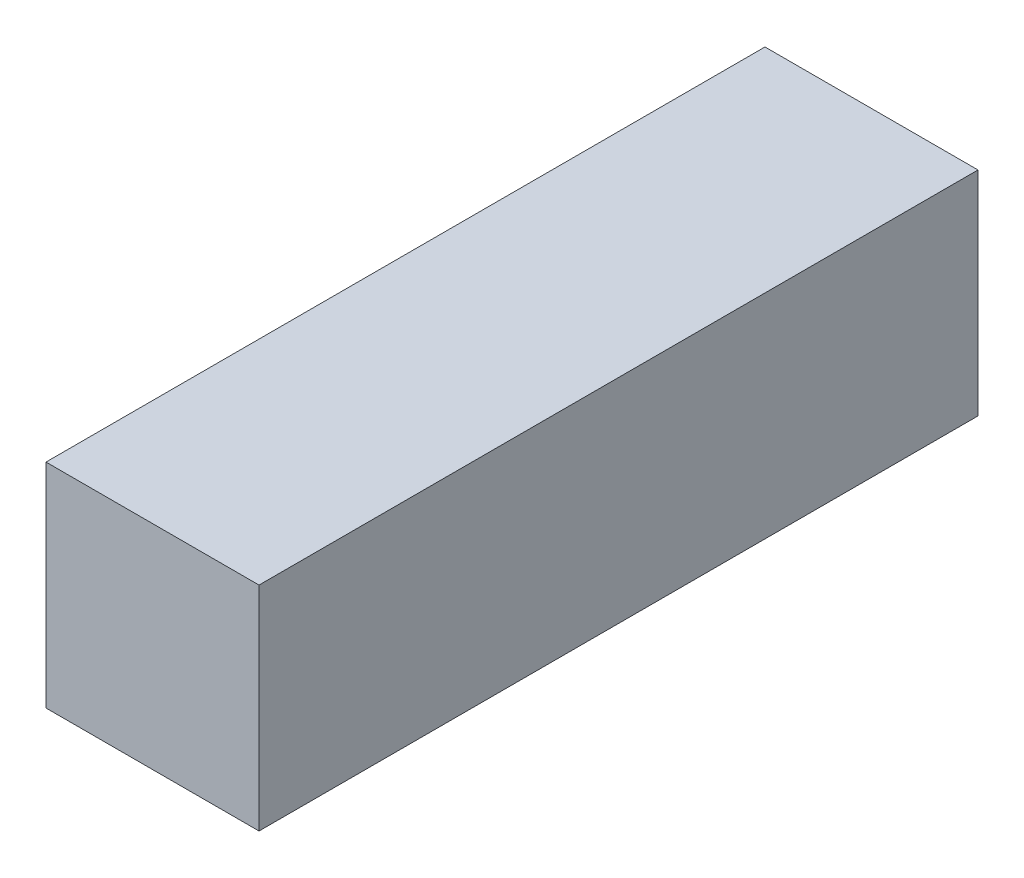
ISO-10303-21;
HEADER;
FILE_DESCRIPTION(('STEP AP214'),'2;1');
FILE_NAME('part.step','',(''),(''),'','','');
FILE_SCHEMA(('AUTOMOTIVE_DESIGN { 1 0 10303 214 1 1 1 1 }'));
ENDSEC;
DATA;
#1=APPLICATION_CONTEXT('core data for automotive mechanical design processes');
#2=APPLICATION_PROTOCOL_DEFINITION('international standard','automotive_design',2000,#1);
#3=PRODUCT_CONTEXT('',#1,'mechanical');
#4=PRODUCT('Part','Part','',(#3));
#5=PRODUCT_RELATED_PRODUCT_CATEGORY('part','',(#4));
#6=PRODUCT_DEFINITION_FORMATION('','',#4);
#7=PRODUCT_DEFINITION_CONTEXT('part definition',#1,'design');
#8=PRODUCT_DEFINITION('design','',#6,#7);
#9=PRODUCT_DEFINITION_SHAPE('','',#8);
#10=(LENGTH_UNIT() NAMED_UNIT(*) SI_UNIT(.MILLI.,.METRE.));
#11=(NAMED_UNIT(*) PLANE_ANGLE_UNIT() SI_UNIT($,.RADIAN.));
#12=(NAMED_UNIT(*) SI_UNIT($,.STERADIAN.) SOLID_ANGLE_UNIT());
#13=UNCERTAINTY_MEASURE_WITH_UNIT(LENGTH_MEASURE(1.E-05),#10,'distance_accuracy_value','');
#14=(GEOMETRIC_REPRESENTATION_CONTEXT(3) GLOBAL_UNCERTAINTY_ASSIGNED_CONTEXT((#13)) GLOBAL_UNIT_ASSIGNED_CONTEXT((#10,
#11,#12)) REPRESENTATION_CONTEXT('',''));
#15=CARTESIAN_POINT('',(0.,0.,0.));
#16=DIRECTION('',(0.,0.,1.));
#17=DIRECTION('',(1.,0.,0.));
#18=AXIS2_PLACEMENT_3D('',#15,#16,#17);
#19=CARTESIAN_POINT('',(-8.,4.,38.3137084989848));
#20=DIRECTION('',(-1.,0.,0.));
#21=DIRECTION('',(0.,-1.,0.));
#22=AXIS2_PLACEMENT_3D('',#19,#20,#21);
#23=PLANE('',#22);
#24=DIRECTION('',(0.,1.,0.));
#25=VECTOR('',#24,1.);
#26=CARTESIAN_POINT('',(-8.,4.,27.));
#27=LINE('',#26,#25);
#28=CARTESIAN_POINT('',(-8.,-4.,27.));
#29=VERTEX_POINT('',#28);
#30=CARTESIAN_POINT('',(-8.,4.,27.));
#31=VERTEX_POINT('',#30);
#32=EDGE_CURVE('E85',#29,#31,#27,.T.);
#33=ORIENTED_EDGE('',*,*,#32,.F.);
#34=DIRECTION('',(0.,0.,-1.));
#35=VECTOR('',#34,1.);
#36=CARTESIAN_POINT('',(-8.,-4.,38.3137084989848));
#37=LINE('',#36,#35);
#38=CARTESIAN_POINT('',(-8.,-4.,0.));
#39=VERTEX_POINT('',#38);
#40=EDGE_CURVE('E39',#29,#39,#37,.T.);
#41=ORIENTED_EDGE('',*,*,#40,.T.);
#42=DIRECTION('',(0.,1.,0.));
#43=VECTOR('',#42,1.);
#44=CARTESIAN_POINT('',(-8.,4.,0.));
#45=LINE('',#44,#43);
#46=CARTESIAN_POINT('',(-8.,4.,0.));
#47=VERTEX_POINT('',#46);
#48=EDGE_CURVE('E83',#39,#47,#45,.T.);
#49=ORIENTED_EDGE('',*,*,#48,.T.);
#50=DIRECTION('',(0.,0.,-1.));
#51=VECTOR('',#50,1.);
#52=CARTESIAN_POINT('',(-8.,4.,38.3137084989848));
#53=LINE('',#52,#51);
#54=EDGE_CURVE('E74',#31,#47,#53,.T.);
#55=ORIENTED_EDGE('',*,*,#54,.F.);
#56=EDGE_LOOP('',(#33,#41,#49,#55));
#57=FACE_BOUND('',#56,.T.);
#58=ADVANCED_FACE('F35',(#57),#23,.F.);
#59=CARTESIAN_POINT('',(-8.,4.,38.3137084989848));
#60=DIRECTION('',(0.,-1.,0.));
#61=DIRECTION('',(1.,0.,0.));
#62=AXIS2_PLACEMENT_3D('',#59,#60,#61);
#63=PLANE('',#62);
#64=DIRECTION('',(-1.,0.,0.));
#65=VECTOR('',#64,1.);
#66=CARTESIAN_POINT('',(-8.,4.,27.));
#67=LINE('',#66,#65);
#68=CARTESIAN_POINT('',(-16.,4.,27.));
#69=VERTEX_POINT('',#68);
#70=EDGE_CURVE('E44',#31,#69,#67,.T.);
#71=ORIENTED_EDGE('',*,*,#70,.F.);
#72=ORIENTED_EDGE('',*,*,#54,.T.);
#73=DIRECTION('',(-1.,0.,0.));
#74=VECTOR('',#73,1.);
#75=CARTESIAN_POINT('',(-8.,4.,0.));
#76=LINE('',#75,#74);
#77=CARTESIAN_POINT('',(-16.,4.,0.));
#78=VERTEX_POINT('',#77);
#79=EDGE_CURVE('E95',#47,#78,#76,.T.);
#80=ORIENTED_EDGE('',*,*,#79,.T.);
#81=DIRECTION('',(0.,0.,-1.));
#82=VECTOR('',#81,1.);
#83=CARTESIAN_POINT('',(-16.,4.,38.3137084989848));
#84=LINE('',#83,#82);
#85=EDGE_CURVE('E104',#69,#78,#84,.T.);
#86=ORIENTED_EDGE('',*,*,#85,.F.);
#87=EDGE_LOOP('',(#71,#72,#80,#86));
#88=FACE_BOUND('',#87,.T.);
#89=ADVANCED_FACE('F108',(#88),#63,.F.);
#90=CARTESIAN_POINT('',(-16.,4.,38.3137084989848));
#91=DIRECTION('',(1.,0.,0.));
#92=DIRECTION('',(0.,0.,-1.));
#93=AXIS2_PLACEMENT_3D('',#90,#91,#92);
#94=PLANE('',#93);
#95=DIRECTION('',(0.,-1.,0.));
#96=VECTOR('',#95,1.);
#97=CARTESIAN_POINT('',(-16.,4.,27.));
#98=LINE('',#97,#96);
#99=CARTESIAN_POINT('',(-16.,-4.,27.));
#100=VERTEX_POINT('',#99);
#101=EDGE_CURVE('E11',#69,#100,#98,.T.);
#102=ORIENTED_EDGE('',*,*,#101,.F.);
#103=ORIENTED_EDGE('',*,*,#85,.T.);
#104=DIRECTION('',(0.,-1.,0.));
#105=VECTOR('',#104,1.);
#106=CARTESIAN_POINT('',(-16.,4.,0.));
#107=LINE('',#106,#105);
#108=CARTESIAN_POINT('',(-16.,-4.,0.));
#109=VERTEX_POINT('',#108);
#110=EDGE_CURVE('E105',#78,#109,#107,.T.);
#111=ORIENTED_EDGE('',*,*,#110,.T.);
#112=DIRECTION('',(0.,0.,-1.));
#113=VECTOR('',#112,1.);
#114=CARTESIAN_POINT('',(-16.,-4.,38.3137084989848));
#115=LINE('',#114,#113);
#116=EDGE_CURVE('E57',#100,#109,#115,.T.);
#117=ORIENTED_EDGE('',*,*,#116,.F.);
#118=EDGE_LOOP('',(#102,#103,#111,#117));
#119=FACE_BOUND('',#118,.T.);
#120=ADVANCED_FACE('F107',(#119),#94,.F.);
#121=CARTESIAN_POINT('',(-8.,-4.,38.3137084989848));
#122=DIRECTION('',(0.,1.,0.));
#123=DIRECTION('',(-1.,0.,0.));
#124=AXIS2_PLACEMENT_3D('',#121,#122,#123);
#125=PLANE('',#124);
#126=DIRECTION('',(1.,0.,0.));
#127=VECTOR('',#126,1.);
#128=CARTESIAN_POINT('',(-8.,-4.,27.));
#129=LINE('',#128,#127);
#130=EDGE_CURVE('E92',#100,#29,#129,.T.);
#131=ORIENTED_EDGE('',*,*,#130,.F.);
#132=ORIENTED_EDGE('',*,*,#116,.T.);
#133=DIRECTION('',(1.,0.,0.));
#134=VECTOR('',#133,1.);
#135=CARTESIAN_POINT('',(-8.,-4.,0.));
#136=LINE('',#135,#134);
#137=EDGE_CURVE('E88',#109,#39,#136,.T.);
#138=ORIENTED_EDGE('',*,*,#137,.T.);
#139=ORIENTED_EDGE('',*,*,#40,.F.);
#140=EDGE_LOOP('',(#131,#132,#138,#139));
#141=FACE_BOUND('',#140,.T.);
#142=ADVANCED_FACE('F89',(#141),#125,.F.);
#143=CARTESIAN_POINT('',(0.,0.,0.));
#144=DIRECTION('',(0.,0.,-1.));
#145=DIRECTION('',(-1.,0.,0.));
#146=AXIS2_PLACEMENT_3D('',#143,#144,#145);
#147=PLANE('',#146);
#148=ORIENTED_EDGE('',*,*,#48,.F.);
#149=ORIENTED_EDGE('',*,*,#137,.F.);
#150=ORIENTED_EDGE('',*,*,#110,.F.);
#151=ORIENTED_EDGE('',*,*,#79,.F.);
#152=EDGE_LOOP('',(#148,#149,#150,#151));
#153=FACE_BOUND('',#152,.T.);
#154=ADVANCED_FACE('F94',(#153),#147,.T.);
#155=CARTESIAN_POINT('',(0.,6.,27.));
#156=DIRECTION('',(0.,0.,1.));
#157=DIRECTION('',(1.,0.,0.));
#158=AXIS2_PLACEMENT_3D('',#155,#156,#157);
#159=PLANE('',#158);
#160=ORIENTED_EDGE('',*,*,#130,.T.);
#161=ORIENTED_EDGE('',*,*,#32,.T.);
#162=ORIENTED_EDGE('',*,*,#70,.T.);
#163=ORIENTED_EDGE('',*,*,#101,.T.);
#164=EDGE_LOOP('',(#160,#161,#162,#163));
#165=FACE_BOUND('',#164,.T.);
#166=ADVANCED_FACE('F37',(#165),#159,.T.);
#167=CLOSED_SHELL('',(#58,#89,#120,#142,#154,#166));
#168=MANIFOLD_SOLID_BREP('B2',#167);
#169=ADVANCED_BREP_SHAPE_REPRESENTATION('',(#18,#168),#14);
#170=SHAPE_DEFINITION_REPRESENTATION(#9,#169);
ENDSEC;
END-ISO-10303-21;
